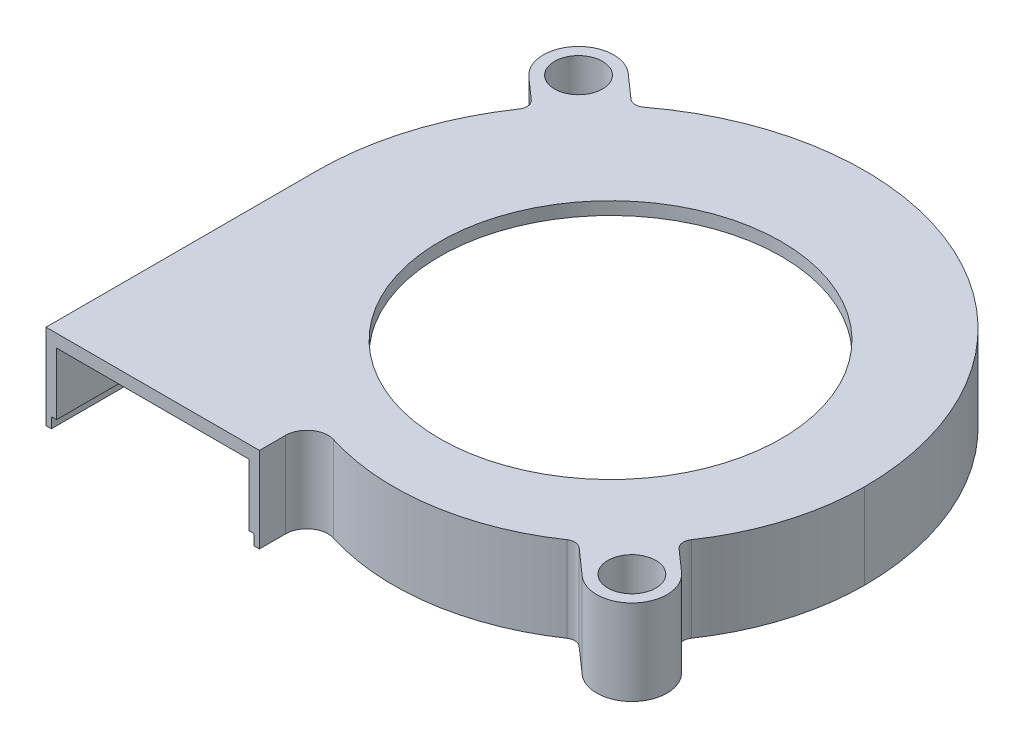
ISO-10303-21;
HEADER;
FILE_DESCRIPTION(('STEP AP214'),'2;1');
FILE_NAME('part.step','',(''),(''),'','','');
FILE_SCHEMA(('AUTOMOTIVE_DESIGN { 1 0 10303 214 1 1 1 1 }'));
ENDSEC;
DATA;
#1=APPLICATION_CONTEXT('core data for automotive mechanical design processes');
#2=APPLICATION_PROTOCOL_DEFINITION('international standard','automotive_design',2000,#1);
#3=PRODUCT_CONTEXT('',#1,'mechanical');
#4=PRODUCT('Part','Part','',(#3));
#5=PRODUCT_RELATED_PRODUCT_CATEGORY('part','',(#4));
#6=PRODUCT_DEFINITION_FORMATION('','',#4);
#7=PRODUCT_DEFINITION_CONTEXT('part definition',#1,'design');
#8=PRODUCT_DEFINITION('design','',#6,#7);
#9=PRODUCT_DEFINITION_SHAPE('','',#8);
#10=(LENGTH_UNIT() NAMED_UNIT(*) SI_UNIT(.MILLI.,.METRE.));
#11=(NAMED_UNIT(*) PLANE_ANGLE_UNIT() SI_UNIT($,.RADIAN.));
#12=(NAMED_UNIT(*) SI_UNIT($,.STERADIAN.) SOLID_ANGLE_UNIT());
#13=UNCERTAINTY_MEASURE_WITH_UNIT(LENGTH_MEASURE(1.E-05),#10,'distance_accuracy_value','');
#14=(GEOMETRIC_REPRESENTATION_CONTEXT(3) GLOBAL_UNCERTAINTY_ASSIGNED_CONTEXT((#13)) GLOBAL_UNIT_ASSIGNED_CONTEXT((#10,
#11,#12)) REPRESENTATION_CONTEXT('',''));
#15=CARTESIAN_POINT('',(0.,0.,0.));
#16=DIRECTION('',(0.,0.,1.));
#17=DIRECTION('',(1.,0.,0.));
#18=AXIS2_PLACEMENT_3D('',#15,#16,#17);
#19=CARTESIAN_POINT('',(-8.5,70.26503959981,25.4));
#20=DIRECTION('',(1.,0.,0.));
#21=DIRECTION('',(0.,0.,-1.));
#22=AXIS2_PLACEMENT_3D('',#19,#20,#21);
#23=PLANE('',#22);
#24=DIRECTION('',(0.,0.,-1.));
#25=VECTOR('',#24,1.);
#26=CARTESIAN_POINT('',(-8.5,-7.,22.9558491109208));
#27=LINE('',#26,#25);
#28=CARTESIAN_POINT('',(-8.5,-7.,25.4));
#29=VERTEX_POINT('',#28);
#30=CARTESIAN_POINT('',(-8.5,-7.,22.9558491109208));
#31=VERTEX_POINT('',#30);
#32=EDGE_CURVE('E585',#29,#31,#27,.T.);
#33=ORIENTED_EDGE('',*,*,#32,.F.);
#34=DIRECTION('',(0.,-1.,0.));
#35=VECTOR('',#34,1.);
#36=CARTESIAN_POINT('',(-8.5,70.26503959981,25.4));
#37=LINE('',#36,#35);
#38=CARTESIAN_POINT('',(-8.5,-1.20000000000001,25.4));
#39=VERTEX_POINT('',#38);
#40=EDGE_CURVE('E496',#39,#29,#37,.T.);
#41=ORIENTED_EDGE('',*,*,#40,.F.);
#42=DIRECTION('',(0.,0.,-1.));
#43=VECTOR('',#42,1.);
#44=CARTESIAN_POINT('',(-8.5,-1.20000000000001,25.4));
#45=LINE('',#44,#43);
#46=CARTESIAN_POINT('',(-8.49999999999999,-1.20000000000001,22.9558491109208));
#47=VERTEX_POINT('',#46);
#48=EDGE_CURVE('E588',#39,#47,#45,.T.);
#49=ORIENTED_EDGE('',*,*,#48,.T.);
#50=DIRECTION('',(0.,-1.,0.));
#51=VECTOR('',#50,1.);
#52=CARTESIAN_POINT('',(-8.5,70.26503959981,22.9558491109208));
#53=LINE('',#52,#51);
#54=EDGE_CURVE('E500',#47,#31,#53,.T.);
#55=ORIENTED_EDGE('',*,*,#54,.T.);
#56=EDGE_LOOP('',(#33,#41,#49,#55));
#57=FACE_BOUND('',#56,.T.);
#58=ADVANCED_FACE('F36',(#57),#23,.F.);
#59=CARTESIAN_POINT('',(-5.5,70.26503959981,22.9558491109208));
#60=DIRECTION('',(0.,-1.,0.));
#61=DIRECTION('',(0.,0.,-1.));
#62=AXIS2_PLACEMENT_3D('',#59,#60,#61);
#63=CYLINDRICAL_SURFACE('',#62,3.);
#64=CARTESIAN_POINT('',(-5.5,-7.,22.9558491109208));
#65=DIRECTION('',(0.,-1.,0.));
#66=DIRECTION('',(0.,0.,-1.));
#67=AXIS2_PLACEMENT_3D('',#64,#65,#66);
#68=CIRCLE('',#67,3.);
#69=CARTESIAN_POINT('',(-4.5985649942554,-7.,20.0944831905794));
#70=VERTEX_POINT('',#69);
#71=EDGE_CURVE('E574',#31,#70,#68,.T.);
#72=ORIENTED_EDGE('',*,*,#71,.F.);
#73=ORIENTED_EDGE('',*,*,#54,.F.);
#74=CARTESIAN_POINT('',(-5.5,-1.20000000000001,22.9558491109208));
#75=DIRECTION('',(0.,-1.,0.));
#76=DIRECTION('',(0.,0.,-1.));
#77=AXIS2_PLACEMENT_3D('',#74,#75,#76);
#78=CIRCLE('',#77,3.);
#79=CARTESIAN_POINT('',(-4.59856499423902,-1.20000000000001,20.0944831905274));
#80=VERTEX_POINT('',#79);
#81=EDGE_CURVE('E487',#47,#80,#78,.T.);
#82=ORIENTED_EDGE('',*,*,#81,.T.);
#83=DIRECTION('',(0.,-1.,0.));
#84=VECTOR('',#83,1.);
#85=CARTESIAN_POINT('',(-4.59856499423902,70.26503959981,20.0944831905274));
#86=LINE('',#85,#84);
#87=EDGE_CURVE('E484',#80,#70,#86,.T.);
#88=ORIENTED_EDGE('',*,*,#87,.T.);
#89=EDGE_LOOP('',(#72,#73,#82,#88));
#90=FACE_BOUND('',#89,.T.);
#91=ADVANCED_FACE('F305',(#90),#63,.T.);
#92=CARTESIAN_POINT('',(1.73193277310925,70.26503959981,0.));
#93=DIRECTION('',(0.,-1.,0.));
#94=DIRECTION('',(0.,0.,-1.));
#95=AXIS2_PLACEMENT_3D('',#92,#93,#94);
#96=CYLINDRICAL_SURFACE('',#95,21.0680672268908);
#97=CARTESIAN_POINT('',(1.73193277310925,-7.,0.));
#98=DIRECTION('',(0.,1.,0.));
#99=DIRECTION('',(0.,0.,-1.));
#100=AXIS2_PLACEMENT_3D('',#97,#98,#99);
#101=CIRCLE('',#100,21.0680672269453);
#102=CARTESIAN_POINT('',(22.800000024916,-7.,-0.000327043078988983));
#103=VERTEX_POINT('',#102);
#104=EDGE_CURVE('E601',#70,#103,#101,.T.);
#105=ORIENTED_EDGE('',*,*,#104,.F.);
#106=ORIENTED_EDGE('',*,*,#87,.F.);
#107=CARTESIAN_POINT('',(1.73193277310925,-1.20000000000001,0.));
#108=DIRECTION('',(0.,-1.,0.));
#109=DIRECTION('',(0.,0.,-1.));
#110=AXIS2_PLACEMENT_3D('',#107,#108,#109);
#111=CIRCLE('',#110,21.0680672268908);
#112=CARTESIAN_POINT('',(22.7999999974641,-1.20000000000001,-0.000326883642031274));
#113=VERTEX_POINT('',#112);
#114=EDGE_CURVE('E478',#80,#113,#111,.F.);
#115=ORIENTED_EDGE('',*,*,#114,.T.);
#116=DIRECTION('',(0.,-1.,0.));
#117=VECTOR('',#116,1.);
#118=CARTESIAN_POINT('',(22.7999999974641,70.26503959981,-0.000326883642031271));
#119=LINE('',#118,#117);
#120=EDGE_CURVE('E482',#113,#103,#119,.T.);
#121=ORIENTED_EDGE('',*,*,#120,.T.);
#122=EDGE_LOOP('',(#105,#106,#115,#121));
#123=FACE_BOUND('',#122,.T.);
#124=ADVANCED_FACE('F311',(#123),#96,.F.);
#125=CARTESIAN_POINT('',(-1.85,70.26503959981,-0.016796874999999));
#126=DIRECTION('',(0.,-1.,0.));
#127=DIRECTION('',(0.,0.,-1.));
#128=AXIS2_PLACEMENT_3D('',#125,#126,#127);
#129=CYLINDRICAL_SURFACE('',#128,24.6500054997072);
#130=CARTESIAN_POINT('',(-1.85,-7.,-0.016796874999999));
#131=DIRECTION('',(0.,1.,0.));
#132=DIRECTION('',(0.,0.,-1.));
#133=AXIS2_PLACEMENT_3D('',#130,#131,#132);
#134=CIRCLE('',#133,24.6500055270525);
#135=CARTESIAN_POINT('',(-26.5000000525161,-7.00000000000001,-0.000327424430267257));
#136=VERTEX_POINT('',#135);
#137=EDGE_CURVE('E53',#103,#136,#134,.T.);
#138=ORIENTED_EDGE('',*,*,#137,.F.);
#139=ORIENTED_EDGE('',*,*,#120,.F.);
#140=CARTESIAN_POINT('',(-1.85,-1.20000000000001,-0.016796874999999));
#141=DIRECTION('',(0.,-1.,0.));
#142=DIRECTION('',(0.,0.,-1.));
#143=AXIS2_PLACEMENT_3D('',#140,#141,#142);
#144=CIRCLE('',#143,24.6500054997072);
#145=CARTESIAN_POINT('',(-26.5000000525161,-1.20000000000001,-0.000327424430267257));
#146=VERTEX_POINT('',#145);
#147=EDGE_CURVE('E488',#113,#146,#144,.F.);
#148=ORIENTED_EDGE('',*,*,#147,.T.);
#149=DIRECTION('',(0.,-1.,0.));
#150=VECTOR('',#149,1.);
#151=CARTESIAN_POINT('',(-26.5000000525161,70.26503959981,-0.000327424430267257));
#152=LINE('',#151,#150);
#153=EDGE_CURVE('E498',#146,#136,#152,.T.);
#154=ORIENTED_EDGE('',*,*,#153,.T.);
#155=EDGE_LOOP('',(#138,#139,#148,#154));
#156=FACE_BOUND('',#155,.T.);
#157=ADVANCED_FACE('F321',(#156),#129,.F.);
#158=CARTESIAN_POINT('',(-26.5000001072067,70.26503959981,-0.000327424393735107));
#159=DIRECTION('',(-1.,0.,4.22068338812948E-09));
#160=DIRECTION('',(4.22068338812948E-09,0.,1.));
#161=AXIS2_PLACEMENT_3D('',#158,#159,#160);
#162=PLANE('',#161);
#163=DIRECTION('',(-4.28055939719574E-11,0.,1.));
#164=VECTOR('',#163,1.);
#165=CARTESIAN_POINT('',(-26.5000000536034,-7.,25.4));
#166=LINE('',#165,#164);
#167=CARTESIAN_POINT('',(-26.5000000536034,-7.,25.4));
#168=VERTEX_POINT('',#167);
#169=EDGE_CURVE('E606',#136,#168,#166,.T.);
#170=ORIENTED_EDGE('',*,*,#169,.F.);
#171=ORIENTED_EDGE('',*,*,#153,.F.);
#172=DIRECTION('',(4.22068338812948E-09,0.,1.));
#173=VECTOR('',#172,1.);
#174=CARTESIAN_POINT('',(-26.5000001072067,-1.20000000000001,-0.000327424393735107));
#175=LINE('',#174,#173);
#176=CARTESIAN_POINT('',(-26.5,-1.20000000000001,25.4));
#177=VERTEX_POINT('',#176);
#178=EDGE_CURVE('E493',#146,#177,#175,.T.);
#179=ORIENTED_EDGE('',*,*,#178,.T.);
#180=DIRECTION('',(0.,-1.,0.));
#181=VECTOR('',#180,1.);
#182=CARTESIAN_POINT('',(-26.5,70.26503959981,25.4));
#183=LINE('',#182,#181);
#184=EDGE_CURVE('E502',#177,#168,#183,.T.);
#185=ORIENTED_EDGE('',*,*,#184,.T.);
#186=EDGE_LOOP('',(#170,#171,#179,#185));
#187=FACE_BOUND('',#186,.T.);
#188=ADVANCED_FACE('F325',(#187),#162,.F.);
#189=CARTESIAN_POINT('',(0.,-8.,0.));
#190=DIRECTION('',(0.,1.,0.));
#191=DIRECTION('',(0.,0.,1.));
#192=AXIS2_PLACEMENT_3D('',#189,#190,#191);
#193=CYLINDRICAL_SURFACE('',#192,16.);
#194=CARTESIAN_POINT('',(0.,0.,0.));
#195=DIRECTION('',(0.,1.,0.));
#196=DIRECTION('',(0.,0.,1.));
#197=AXIS2_PLACEMENT_3D('',#194,#195,#196);
#198=CIRCLE('',#197,16.);
#199=CARTESIAN_POINT('',(0.,0.,16.));
#200=VERTEX_POINT('',#199);
#201=EDGE_CURVE('E349',#200,#200,#198,.T.);
#202=ORIENTED_EDGE('',*,*,#201,.T.);
#203=EDGE_LOOP('',(#202));
#204=FACE_BOUND('',#203,.T.);
#205=CARTESIAN_POINT('',(0.,-1.2,0.));
#206=DIRECTION('',(0.,-1.,0.));
#207=DIRECTION('',(0.,0.,-1.));
#208=AXIS2_PLACEMENT_3D('',#205,#206,#207);
#209=CIRCLE('',#208,16.);
#210=CARTESIAN_POINT('',(0.,-1.2,-16.));
#211=VERTEX_POINT('',#210);
#212=EDGE_CURVE('E40',#211,#211,#209,.F.);
#213=ORIENTED_EDGE('',*,*,#212,.F.);
#214=EDGE_LOOP('',(#213));
#215=FACE_BOUND('',#214,.T.);
#216=ADVANCED_FACE('F302',(#204,#215),#193,.F.);
#217=CARTESIAN_POINT('',(-23.,-8.,-20.));
#218=DIRECTION('',(0.,1.,0.));
#219=DIRECTION('',(0.,0.,1.));
#220=AXIS2_PLACEMENT_3D('',#217,#218,#219);
#221=CYLINDRICAL_SURFACE('',#220,3.3);
#222=CARTESIAN_POINT('',(-23.,0.,-20.));
#223=DIRECTION('',(0.,1.,0.));
#224=DIRECTION('',(0.,0.,-1.));
#225=AXIS2_PLACEMENT_3D('',#222,#223,#224);
#226=CIRCLE('',#225,3.3);
#227=CARTESIAN_POINT('',(-20.8147472716434,0.,-22.4727859820878));
#228=VERTEX_POINT('',#227);
#229=CARTESIAN_POINT('',(-25.1852527283566,0.,-17.5272140179122));
#230=VERTEX_POINT('',#229);
#231=EDGE_CURVE('E210',#228,#230,#226,.T.);
#232=ORIENTED_EDGE('',*,*,#231,.F.);
#233=DIRECTION('',(0.,1.,0.));
#234=VECTOR('',#233,1.);
#235=CARTESIAN_POINT('',(-20.8147472716434,-8.,-22.4727859820878));
#236=LINE('',#235,#234);
#237=CARTESIAN_POINT('',(-20.8147472716434,-8.,-22.4727859820878));
#238=VERTEX_POINT('',#237);
#239=EDGE_CURVE('E12',#238,#228,#236,.T.);
#240=ORIENTED_EDGE('',*,*,#239,.F.);
#241=CARTESIAN_POINT('',(-23.,-8.,-20.));
#242=DIRECTION('',(0.,1.,0.));
#243=DIRECTION('',(0.,0.,-1.));
#244=AXIS2_PLACEMENT_3D('',#241,#242,#243);
#245=CIRCLE('',#244,3.3);
#246=CARTESIAN_POINT('',(-25.1852527283566,-8.,-17.5272140179122));
#247=VERTEX_POINT('',#246);
#248=EDGE_CURVE('E261',#238,#247,#245,.T.);
#249=ORIENTED_EDGE('',*,*,#248,.T.);
#250=DIRECTION('',(0.,1.,0.));
#251=VECTOR('',#250,1.);
#252=CARTESIAN_POINT('',(-25.1852527283566,-8.,-17.5272140179122));
#253=LINE('',#252,#251);
#254=EDGE_CURVE('E129',#247,#230,#253,.T.);
#255=ORIENTED_EDGE('',*,*,#254,.T.);
#256=EDGE_LOOP('',(#232,#240,#249,#255));
#257=FACE_BOUND('',#256,.T.);
#258=ADVANCED_FACE('F38',(#257),#221,.T.);
#259=CARTESIAN_POINT('',(-20.8147472716434,-8.,-22.4727859820878));
#260=DIRECTION('',(0.66219779647171,0.,-0.749329085481147));
#261=DIRECTION('',(-0.749329085481147,0.,-0.66219779647171));
#262=AXIS2_PLACEMENT_3D('',#259,#260,#261);
#263=PLANE('',#262);
#264=DIRECTION('',(-0.749329085481147,0.,-0.66219779647171));
#265=VECTOR('',#264,1.);
#266=CARTESIAN_POINT('',(-20.8147472716434,0.,-22.4727859820878));
#267=LINE('',#266,#265);
#268=CARTESIAN_POINT('',(-18.5989053771657,0.,-20.5146001218517));
#269=VERTEX_POINT('',#268);
#270=EDGE_CURVE('E259',#269,#228,#267,.T.);
#271=ORIENTED_EDGE('',*,*,#270,.F.);
#272=DIRECTION('',(0.,1.,0.));
#273=VECTOR('',#272,1.);
#274=CARTESIAN_POINT('',(-18.5989053771657,-8.,-20.5146001218517));
#275=LINE('',#274,#273);
#276=CARTESIAN_POINT('',(-18.5989053771657,-8.,-20.5146001218517));
#277=VERTEX_POINT('',#276);
#278=EDGE_CURVE('E45',#277,#269,#275,.T.);
#279=ORIENTED_EDGE('',*,*,#278,.F.);
#280=DIRECTION('',(-0.749329085481147,0.,-0.66219779647171));
#281=VECTOR('',#280,1.);
#282=CARTESIAN_POINT('',(-20.8147472716434,-8.,-22.4727859820878));
#283=LINE('',#282,#281);
#284=EDGE_CURVE('E200',#277,#238,#283,.T.);
#285=ORIENTED_EDGE('',*,*,#284,.T.);
#286=ORIENTED_EDGE('',*,*,#239,.T.);
#287=EDGE_LOOP('',(#271,#279,#285,#286));
#288=FACE_BOUND('',#287,.T.);
#289=ADVANCED_FACE('F294',(#288),#263,.T.);
#290=CARTESIAN_POINT('',(-17.936707580694,-8.,-21.2639292073329));
#291=DIRECTION('',(0.,1.,0.));
#292=DIRECTION('',(0.,0.,1.));
#293=AXIS2_PLACEMENT_3D('',#290,#291,#292);
#294=CYLINDRICAL_SURFACE('',#293,1.);
#295=CARTESIAN_POINT('',(-17.936707580694,0.,-21.2639292073329));
#296=DIRECTION('',(0.,-1.,0.));
#297=DIRECTION('',(0.,0.,1.));
#298=AXIS2_PLACEMENT_3D('',#295,#296,#297);
#299=CIRCLE('',#298,1.);
#300=CARTESIAN_POINT('',(-17.3330789029862,0.,-20.4666636183045));
#301=VERTEX_POINT('',#300);
#302=EDGE_CURVE('E185',#301,#269,#299,.T.);
#303=ORIENTED_EDGE('',*,*,#302,.F.);
#304=DIRECTION('',(0.,1.,0.));
#305=VECTOR('',#304,1.);
#306=CARTESIAN_POINT('',(-17.3330789029862,-8.,-20.4666636183045));
#307=LINE('',#306,#305);
#308=CARTESIAN_POINT('',(-17.3330789029862,-8.,-20.4666636183045));
#309=VERTEX_POINT('',#308);
#310=EDGE_CURVE('E179',#309,#301,#307,.T.);
#311=ORIENTED_EDGE('',*,*,#310,.F.);
#312=CARTESIAN_POINT('',(-17.936707580694,-8.,-21.2639292073329));
#313=DIRECTION('',(0.,-1.,0.));
#314=DIRECTION('',(0.,0.,1.));
#315=AXIS2_PLACEMENT_3D('',#312,#313,#314);
#316=CIRCLE('',#315,1.);
#317=EDGE_CURVE('E182',#309,#277,#316,.T.);
#318=ORIENTED_EDGE('',*,*,#317,.T.);
#319=ORIENTED_EDGE('',*,*,#278,.T.);
#320=EDGE_LOOP('',(#303,#311,#318,#319));
#321=FACE_BOUND('',#320,.T.);
#322=ADVANCED_FACE('F181',(#321),#294,.F.);
#323=CARTESIAN_POINT('',(-1.85,-8.,-0.016796874999999));
#324=DIRECTION('',(0.,1.,0.));
#325=DIRECTION('',(0.,0.,1.));
#326=AXIS2_PLACEMENT_3D('',#323,#324,#325);
#327=CYLINDRICAL_SURFACE('',#326,25.6500054997072);
#328=CARTESIAN_POINT('',(-1.85,0.,-0.016796874999999));
#329=DIRECTION('',(0.,1.,0.));
#330=DIRECTION('',(0.,0.,1.));
#331=AXIS2_PLACEMENT_3D('',#328,#329,#330);
#332=CIRCLE('',#331,25.6500054997072);
#333=CARTESIAN_POINT('',(23.8,0.,0.));
#334=VERTEX_POINT('',#333);
#335=EDGE_CURVE('E256',#334,#301,#332,.T.);
#336=ORIENTED_EDGE('',*,*,#335,.F.);
#337=DIRECTION('',(0.,1.,0.));
#338=VECTOR('',#337,1.);
#339=CARTESIAN_POINT('',(23.8,-8.,0.));
#340=LINE('',#339,#338);
#341=CARTESIAN_POINT('',(23.8,-8.,0.));
#342=VERTEX_POINT('',#341);
#343=EDGE_CURVE('E190',#342,#334,#340,.T.);
#344=ORIENTED_EDGE('',*,*,#343,.F.);
#345=CARTESIAN_POINT('',(-1.85,-8.,-0.016796874999999));
#346=DIRECTION('',(0.,1.,0.));
#347=DIRECTION('',(0.,0.,1.));
#348=AXIS2_PLACEMENT_3D('',#345,#346,#347);
#349=CIRCLE('',#348,25.6500054997072);
#350=EDGE_CURVE('E198',#342,#309,#349,.T.);
#351=ORIENTED_EDGE('',*,*,#350,.T.);
#352=ORIENTED_EDGE('',*,*,#310,.T.);
#353=EDGE_LOOP('',(#336,#344,#351,#352));
#354=FACE_BOUND('',#353,.T.);
#355=ADVANCED_FACE('F202',(#354),#327,.T.);
#356=CARTESIAN_POINT('',(1.73193277310925,-8.,0.));
#357=DIRECTION('',(0.,1.,0.));
#358=DIRECTION('',(0.,0.,1.));
#359=AXIS2_PLACEMENT_3D('',#356,#357,#358);
#360=CYLINDRICAL_SURFACE('',#359,22.0680672268908);
#361=CARTESIAN_POINT('',(1.73193277310925,0.,0.));
#362=DIRECTION('',(0.,1.,0.));
#363=DIRECTION('',(0.,0.,-1.));
#364=AXIS2_PLACEMENT_3D('',#361,#362,#363);
#365=CIRCLE('',#364,22.0680672268908);
#366=CARTESIAN_POINT('',(19.9790752063348,0.,12.4113409489929));
#367=VERTEX_POINT('',#366);
#368=EDGE_CURVE('E253',#367,#334,#365,.T.);
#369=ORIENTED_EDGE('',*,*,#368,.F.);
#370=DIRECTION('',(0.,1.,0.));
#371=VECTOR('',#370,1.);
#372=CARTESIAN_POINT('',(19.9790752063348,-8.,12.4113409489929));
#373=LINE('',#372,#371);
#374=CARTESIAN_POINT('',(19.9790752063348,-8.,12.4113409489929));
#375=VERTEX_POINT('',#374);
#376=EDGE_CURVE('E265',#375,#367,#373,.T.);
#377=ORIENTED_EDGE('',*,*,#376,.F.);
#378=CARTESIAN_POINT('',(1.73193277310925,-8.,0.));
#379=DIRECTION('',(0.,1.,0.));
#380=DIRECTION('',(0.,0.,-1.));
#381=AXIS2_PLACEMENT_3D('',#378,#379,#380);
#382=CIRCLE('',#381,22.0680672268908);
#383=EDGE_CURVE('E203',#375,#342,#382,.T.);
#384=ORIENTED_EDGE('',*,*,#383,.T.);
#385=ORIENTED_EDGE('',*,*,#343,.T.);
#386=EDGE_LOOP('',(#369,#377,#384,#385));
#387=FACE_BOUND('',#386,.T.);
#388=ADVANCED_FACE('F664',(#387),#360,.T.);
#389=CARTESIAN_POINT('',(20.8059325040591,-8.,12.9737527280304));
#390=DIRECTION('',(0.,1.,0.));
#391=DIRECTION('',(0.,0.,1.));
#392=AXIS2_PLACEMENT_3D('',#389,#390,#391);
#393=CYLINDRICAL_SURFACE('',#392,1.);
#394=CARTESIAN_POINT('',(20.8059325040591,0.,12.9737527280304));
#395=DIRECTION('',(0.,-1.,0.));
#396=DIRECTION('',(0.,0.,-1.));
#397=AXIS2_PLACEMENT_3D('',#394,#395,#396);
#398=CIRCLE('',#397,1.);
#399=CARTESIAN_POINT('',(20.1437347075874,0.,13.7230818135115));
#400=VERTEX_POINT('',#399);
#401=EDGE_CURVE('E250',#400,#367,#398,.T.);
#402=ORIENTED_EDGE('',*,*,#401,.F.);
#403=DIRECTION('',(0.,1.,0.));
#404=VECTOR('',#403,1.);
#405=CARTESIAN_POINT('',(20.1437347075874,-8.,13.7230818135115));
#406=LINE('',#405,#404);
#407=CARTESIAN_POINT('',(20.1437347075874,-8.,13.7230818135115));
#408=VERTEX_POINT('',#407);
#409=EDGE_CURVE('E267',#408,#400,#406,.T.);
#410=ORIENTED_EDGE('',*,*,#409,.F.);
#411=CARTESIAN_POINT('',(20.8059325040591,-8.,12.9737527280304));
#412=DIRECTION('',(0.,-1.,0.));
#413=DIRECTION('',(0.,0.,-1.));
#414=AXIS2_PLACEMENT_3D('',#411,#412,#413);
#415=CIRCLE('',#414,1.);
#416=EDGE_CURVE('E205',#408,#375,#415,.T.);
#417=ORIENTED_EDGE('',*,*,#416,.T.);
#418=ORIENTED_EDGE('',*,*,#376,.T.);
#419=EDGE_LOOP('',(#402,#410,#417,#418));
#420=FACE_BOUND('',#419,.T.);
#421=ADVANCED_FACE('F406',(#420),#393,.F.);
#422=CARTESIAN_POINT('',(22.1852527283566,-8.,15.5272140179122));
#423=DIRECTION('',(0.66219779647171,0.,-0.749329085481147));
#424=DIRECTION('',(-0.749329085481147,0.,-0.66219779647171));
#425=AXIS2_PLACEMENT_3D('',#422,#423,#424);
#426=PLANE('',#425);
#427=DIRECTION('',(-0.749329085481146,0.,-0.66219779647171));
#428=VECTOR('',#427,1.);
#429=CARTESIAN_POINT('',(22.1852527283566,0.,15.5272140179122));
#430=LINE('',#429,#428);
#431=CARTESIAN_POINT('',(22.1852527283566,0.,15.5272140179122));
#432=VERTEX_POINT('',#431);
#433=EDGE_CURVE('E247',#432,#400,#430,.T.);
#434=ORIENTED_EDGE('',*,*,#433,.F.);
#435=DIRECTION('',(0.,1.,0.));
#436=VECTOR('',#435,1.);
#437=CARTESIAN_POINT('',(22.1852527283566,-8.,15.5272140179122));
#438=LINE('',#437,#436);
#439=CARTESIAN_POINT('',(22.1852527283566,-8.,15.5272140179122));
#440=VERTEX_POINT('',#439);
#441=EDGE_CURVE('E269',#440,#432,#438,.T.);
#442=ORIENTED_EDGE('',*,*,#441,.F.);
#443=DIRECTION('',(-0.749329085481146,0.,-0.66219779647171));
#444=VECTOR('',#443,1.);
#445=CARTESIAN_POINT('',(22.1852527283566,-8.,15.5272140179122));
#446=LINE('',#445,#444);
#447=EDGE_CURVE('E400',#440,#408,#446,.T.);
#448=ORIENTED_EDGE('',*,*,#447,.T.);
#449=ORIENTED_EDGE('',*,*,#409,.T.);
#450=EDGE_LOOP('',(#434,#442,#448,#449));
#451=FACE_BOUND('',#450,.T.);
#452=ADVANCED_FACE('F412',(#451),#426,.T.);
#453=CARTESIAN_POINT('',(20.,-8.,18.));
#454=DIRECTION('',(0.,1.,0.));
#455=DIRECTION('',(0.,0.,1.));
#456=AXIS2_PLACEMENT_3D('',#453,#454,#455);
#457=CYLINDRICAL_SURFACE('',#456,3.3);
#458=CARTESIAN_POINT('',(20.,0.,18.));
#459=DIRECTION('',(0.,1.,0.));
#460=DIRECTION('',(0.,0.,-1.));
#461=AXIS2_PLACEMENT_3D('',#458,#459,#460);
#462=CIRCLE('',#461,3.3);
#463=CARTESIAN_POINT('',(17.8147472716434,0.,20.4727859820878));
#464=VERTEX_POINT('',#463);
#465=EDGE_CURVE('E244',#464,#432,#462,.T.);
#466=ORIENTED_EDGE('',*,*,#465,.F.);
#467=DIRECTION('',(0.,1.,0.));
#468=VECTOR('',#467,1.);
#469=CARTESIAN_POINT('',(17.8147472716434,-8.,20.4727859820878));
#470=LINE('',#469,#468);
#471=CARTESIAN_POINT('',(17.8147472716434,-8.,20.4727859820878));
#472=VERTEX_POINT('',#471);
#473=EDGE_CURVE('E271',#472,#464,#470,.T.);
#474=ORIENTED_EDGE('',*,*,#473,.F.);
#475=CARTESIAN_POINT('',(20.,-8.,18.));
#476=DIRECTION('',(0.,1.,0.));
#477=DIRECTION('',(0.,0.,-1.));
#478=AXIS2_PLACEMENT_3D('',#475,#476,#477);
#479=CIRCLE('',#478,3.3);
#480=EDGE_CURVE('E397',#472,#440,#479,.T.);
#481=ORIENTED_EDGE('',*,*,#480,.T.);
#482=ORIENTED_EDGE('',*,*,#441,.T.);
#483=EDGE_LOOP('',(#466,#474,#481,#482));
#484=FACE_BOUND('',#483,.T.);
#485=ADVANCED_FACE('F415',(#484),#457,.T.);
#486=CARTESIAN_POINT('',(17.8147472716434,-8.,20.4727859820878));
#487=DIRECTION('',(-0.66219779647171,0.,0.749329085481147));
#488=DIRECTION('',(0.749329085481147,0.,0.66219779647171));
#489=AXIS2_PLACEMENT_3D('',#486,#487,#488);
#490=PLANE('',#489);
#491=DIRECTION('',(0.749329085481147,0.,0.66219779647171));
#492=VECTOR('',#491,1.);
#493=CARTESIAN_POINT('',(17.8147472716434,0.,20.4727859820878));
#494=LINE('',#493,#492);
#495=CARTESIAN_POINT('',(15.3769800356374,0.,18.3184800525942));
#496=VERTEX_POINT('',#495);
#497=EDGE_CURVE('E241',#496,#464,#494,.T.);
#498=ORIENTED_EDGE('',*,*,#497,.F.);
#499=DIRECTION('',(0.,1.,0.));
#500=VECTOR('',#499,1.);
#501=CARTESIAN_POINT('',(15.3769800356374,-8.,18.3184800525942));
#502=LINE('',#501,#500);
#503=CARTESIAN_POINT('',(15.3769800356374,-8.,18.3184800525942));
#504=VERTEX_POINT('',#503);
#505=EDGE_CURVE('E273',#504,#496,#502,.T.);
#506=ORIENTED_EDGE('',*,*,#505,.F.);
#507=DIRECTION('',(0.749329085481147,0.,0.66219779647171));
#508=VECTOR('',#507,1.);
#509=CARTESIAN_POINT('',(17.8147472716434,-8.,20.4727859820878));
#510=LINE('',#509,#508);
#511=EDGE_CURVE('E394',#504,#472,#510,.T.);
#512=ORIENTED_EDGE('',*,*,#511,.T.);
#513=ORIENTED_EDGE('',*,*,#473,.T.);
#514=EDGE_LOOP('',(#498,#506,#512,#513));
#515=FACE_BOUND('',#514,.T.);
#516=ADVANCED_FACE('F420',(#515),#490,.T.);
#517=CARTESIAN_POINT('',(14.7147822391657,-8.,19.0678091380753));
#518=DIRECTION('',(0.,1.,0.));
#519=DIRECTION('',(0.,0.,1.));
#520=AXIS2_PLACEMENT_3D('',#517,#518,#519);
#521=CYLINDRICAL_SURFACE('',#520,0.999999999999999);
#522=CARTESIAN_POINT('',(14.7147822391657,0.,19.0678091380753));
#523=DIRECTION('',(0.,-1.,0.));
#524=DIRECTION('',(0.,0.,1.));
#525=AXIS2_PLACEMENT_3D('',#522,#523,#524);
#526=CIRCLE('',#525,0.999999999999999);
#527=CARTESIAN_POINT('',(14.1519761168165,0.,18.2412202023604));
#528=VERTEX_POINT('',#527);
#529=EDGE_CURVE('E238',#528,#496,#526,.T.);
#530=ORIENTED_EDGE('',*,*,#529,.F.);
#531=DIRECTION('',(0.,1.,0.));
#532=VECTOR('',#531,1.);
#533=CARTESIAN_POINT('',(14.1519761168165,-8.,18.2412202023604));
#534=LINE('',#533,#532);
#535=CARTESIAN_POINT('',(14.1519761168165,-8.,18.2412202023604));
#536=VERTEX_POINT('',#535);
#537=EDGE_CURVE('E275',#536,#528,#534,.T.);
#538=ORIENTED_EDGE('',*,*,#537,.F.);
#539=CARTESIAN_POINT('',(14.7147822391657,-8.,19.0678091380753));
#540=DIRECTION('',(0.,-1.,0.));
#541=DIRECTION('',(0.,0.,1.));
#542=AXIS2_PLACEMENT_3D('',#539,#540,#541);
#543=CIRCLE('',#542,0.999999999999999);
#544=EDGE_CURVE('E391',#536,#504,#543,.T.);
#545=ORIENTED_EDGE('',*,*,#544,.T.);
#546=ORIENTED_EDGE('',*,*,#505,.T.);
#547=EDGE_LOOP('',(#530,#538,#545,#546));
#548=FACE_BOUND('',#547,.T.);
#549=ADVANCED_FACE('F423',(#548),#521,.F.);
#550=CARTESIAN_POINT('',(1.73193277310925,-8.,0.));
#551=DIRECTION('',(0.,1.,0.));
#552=DIRECTION('',(0.,0.,1.));
#553=AXIS2_PLACEMENT_3D('',#550,#551,#552);
#554=CYLINDRICAL_SURFACE('',#553,22.0680672268908);
#555=CARTESIAN_POINT('',(1.73193277310925,0.,0.));
#556=DIRECTION('',(0.,1.,0.));
#557=DIRECTION('',(0.,0.,-1.));
#558=AXIS2_PLACEMENT_3D('',#555,#556,#557);
#559=CIRCLE('',#558,22.0680672268908);
#560=CARTESIAN_POINT('',(-4.89904332949268,0.,21.0482718306585));
#561=VERTEX_POINT('',#560);
#562=EDGE_CURVE('E235',#561,#528,#559,.T.);
#563=ORIENTED_EDGE('',*,*,#562,.F.);
#564=DIRECTION('',(0.,1.,0.));
#565=VECTOR('',#564,1.);
#566=CARTESIAN_POINT('',(-4.89904332949268,-8.,21.0482718306585));
#567=LINE('',#566,#565);
#568=CARTESIAN_POINT('',(-4.89904332949268,-8.,21.0482718306585));
#569=VERTEX_POINT('',#568);
#570=EDGE_CURVE('E277',#569,#561,#567,.T.);
#571=ORIENTED_EDGE('',*,*,#570,.F.);
#572=CARTESIAN_POINT('',(1.73193277310925,-8.,0.));
#573=DIRECTION('',(0.,1.,0.));
#574=DIRECTION('',(0.,0.,-1.));
#575=AXIS2_PLACEMENT_3D('',#572,#573,#574);
#576=CIRCLE('',#575,22.0680672268908);
#577=EDGE_CURVE('E388',#569,#536,#576,.T.);
#578=ORIENTED_EDGE('',*,*,#577,.T.);
#579=ORIENTED_EDGE('',*,*,#537,.T.);
#580=EDGE_LOOP('',(#563,#571,#578,#579));
#581=FACE_BOUND('',#580,.T.);
#582=ADVANCED_FACE('F428',(#581),#554,.T.);
#583=CARTESIAN_POINT('',(-5.5,-8.,22.9558491109208));
#584=DIRECTION('',(0.,1.,0.));
#585=DIRECTION('',(0.,0.,1.));
#586=AXIS2_PLACEMENT_3D('',#583,#584,#585);
#587=CYLINDRICAL_SURFACE('',#586,2.);
#588=CARTESIAN_POINT('',(-5.5,0.,22.9558491109208));
#589=DIRECTION('',(0.,-1.,0.));
#590=DIRECTION('',(0.,0.,1.));
#591=AXIS2_PLACEMENT_3D('',#588,#589,#590);
#592=CIRCLE('',#591,2.);
#593=CARTESIAN_POINT('',(-7.5,0.,22.9558491109208));
#594=VERTEX_POINT('',#593);
#595=EDGE_CURVE('E232',#594,#561,#592,.T.);
#596=ORIENTED_EDGE('',*,*,#595,.F.);
#597=DIRECTION('',(0.,1.,0.));
#598=VECTOR('',#597,1.);
#599=CARTESIAN_POINT('',(-7.5,-8.,22.9558491109208));
#600=LINE('',#599,#598);
#601=CARTESIAN_POINT('',(-7.5,-8.,22.9558491109208));
#602=VERTEX_POINT('',#601);
#603=EDGE_CURVE('E279',#602,#594,#600,.T.);
#604=ORIENTED_EDGE('',*,*,#603,.F.);
#605=CARTESIAN_POINT('',(-5.5,-8.,22.9558491109208));
#606=DIRECTION('',(0.,-1.,0.));
#607=DIRECTION('',(0.,0.,1.));
#608=AXIS2_PLACEMENT_3D('',#605,#606,#607);
#609=CIRCLE('',#608,2.);
#610=EDGE_CURVE('E385',#602,#569,#609,.T.);
#611=ORIENTED_EDGE('',*,*,#610,.T.);
#612=ORIENTED_EDGE('',*,*,#570,.T.);
#613=EDGE_LOOP('',(#596,#604,#611,#612));
#614=FACE_BOUND('',#613,.T.);
#615=ADVANCED_FACE('F431',(#614),#587,.F.);
#616=CARTESIAN_POINT('',(-7.5,-8.,25.4));
#617=DIRECTION('',(1.,0.,0.));
#618=DIRECTION('',(0.,0.,-1.));
#619=AXIS2_PLACEMENT_3D('',#616,#617,#618);
#620=PLANE('',#619);
#621=DIRECTION('',(0.,0.,-1.));
#622=VECTOR('',#621,1.);
#623=CARTESIAN_POINT('',(-7.5,0.,25.4));
#624=LINE('',#623,#622);
#625=CARTESIAN_POINT('',(-7.5,0.,25.4));
#626=VERTEX_POINT('',#625);
#627=EDGE_CURVE('E229',#626,#594,#624,.T.);
#628=ORIENTED_EDGE('',*,*,#627,.F.);
#629=DIRECTION('',(0.,1.,0.));
#630=VECTOR('',#629,1.);
#631=CARTESIAN_POINT('',(-7.5,-8.,25.4));
#632=LINE('',#631,#630);
#633=CARTESIAN_POINT('',(-7.5,-8.,25.4));
#634=VERTEX_POINT('',#633);
#635=EDGE_CURVE('E281',#634,#626,#632,.T.);
#636=ORIENTED_EDGE('',*,*,#635,.F.);
#637=DIRECTION('',(0.,0.,-1.));
#638=VECTOR('',#637,1.);
#639=CARTESIAN_POINT('',(-7.5,-8.,25.4));
#640=LINE('',#639,#638);
#641=EDGE_CURVE('E382',#634,#602,#640,.T.);
#642=ORIENTED_EDGE('',*,*,#641,.T.);
#643=ORIENTED_EDGE('',*,*,#603,.T.);
#644=EDGE_LOOP('',(#628,#636,#642,#643));
#645=FACE_BOUND('',#644,.T.);
#646=ADVANCED_FACE('F437',(#645),#620,.T.);
#647=CARTESIAN_POINT('',(-27.5,-8.,25.4));
#648=DIRECTION('',(0.,0.,1.));
#649=DIRECTION('',(1.,0.,0.));
#650=AXIS2_PLACEMENT_3D('',#647,#648,#649);
#651=PLANE('',#650);
#652=DIRECTION('',(0.,-1.,0.));
#653=VECTOR('',#652,1.);
#654=CARTESIAN_POINT('',(-27.0000000525161,-7.,25.4));
#655=LINE('',#654,#653);
#656=CARTESIAN_POINT('',(-27.0000000525161,-7.,25.4));
#657=VERTEX_POINT('',#656);
#658=CARTESIAN_POINT('',(-27.0000000525161,-8.,25.4));
#659=VERTEX_POINT('',#658);
#660=EDGE_CURVE('E555',#657,#659,#655,.T.);
#661=ORIENTED_EDGE('',*,*,#660,.F.);
#662=DIRECTION('',(-1.,0.,0.));
#663=VECTOR('',#662,1.);
#664=CARTESIAN_POINT('',(-27.0000000525161,-7.,25.4));
#665=LINE('',#664,#663);
#666=EDGE_CURVE('E608',#168,#657,#665,.T.);
#667=ORIENTED_EDGE('',*,*,#666,.F.);
#668=ORIENTED_EDGE('',*,*,#184,.F.);
#669=DIRECTION('',(1.,0.,0.));
#670=VECTOR('',#669,1.);
#671=CARTESIAN_POINT('',(-26.5,-1.20000000000001,25.4));
#672=LINE('',#671,#670);
#673=EDGE_CURVE('E509',#177,#39,#672,.T.);
#674=ORIENTED_EDGE('',*,*,#673,.T.);
#675=ORIENTED_EDGE('',*,*,#40,.T.);
#676=DIRECTION('',(-1.,0.,0.));
#677=VECTOR('',#676,1.);
#678=CARTESIAN_POINT('',(-8.5,-7.,25.4));
#679=LINE('',#678,#677);
#680=CARTESIAN_POINT('',(-8.,-7.,25.4));
#681=VERTEX_POINT('',#680);
#682=EDGE_CURVE('E626',#681,#29,#679,.T.);
#683=ORIENTED_EDGE('',*,*,#682,.F.);
#684=DIRECTION('',(0.,-1.,0.));
#685=VECTOR('',#684,1.);
#686=CARTESIAN_POINT('',(-8.,-7.,25.4));
#687=LINE('',#686,#685);
#688=CARTESIAN_POINT('',(-8.,-8.,25.4));
#689=VERTEX_POINT('',#688);
#690=EDGE_CURVE('E446',#681,#689,#687,.T.);
#691=ORIENTED_EDGE('',*,*,#690,.T.);
#692=DIRECTION('',(1.,0.,0.));
#693=VECTOR('',#692,1.);
#694=CARTESIAN_POINT('',(-27.5,-8.,25.4));
#695=LINE('',#694,#693);
#696=EDGE_CURVE('E378',#689,#634,#695,.T.);
#697=ORIENTED_EDGE('',*,*,#696,.T.);
#698=ORIENTED_EDGE('',*,*,#635,.T.);
#699=DIRECTION('',(1.,0.,0.));
#700=VECTOR('',#699,1.);
#701=CARTESIAN_POINT('',(-27.5,0.,25.4));
#702=LINE('',#701,#700);
#703=CARTESIAN_POINT('',(-27.5,0.,25.4));
#704=VERTEX_POINT('',#703);
#705=EDGE_CURVE('E226',#704,#626,#702,.T.);
#706=ORIENTED_EDGE('',*,*,#705,.F.);
#707=DIRECTION('',(0.,1.,0.));
#708=VECTOR('',#707,1.);
#709=CARTESIAN_POINT('',(-27.5,-8.,25.4));
#710=LINE('',#709,#708);
#711=CARTESIAN_POINT('',(-27.5,-8.,25.4));
#712=VERTEX_POINT('',#711);
#713=EDGE_CURVE('E283',#712,#704,#710,.T.);
#714=ORIENTED_EDGE('',*,*,#713,.F.);
#715=EDGE_CURVE('E379',#712,#659,#695,.T.);
#716=ORIENTED_EDGE('',*,*,#715,.T.);
#717=EDGE_LOOP('',(#661,#667,#668,#674,#675,#683,#691,#697,#698,#706,#714,#716));
#718=FACE_BOUND('',#717,.T.);
#719=ADVANCED_FACE('F441',(#718),#651,.T.);
#720=CARTESIAN_POINT('',(-27.5,-8.,25.4));
#721=DIRECTION('',(-1.,0.,0.));
#722=DIRECTION('',(0.,0.,1.));
#723=AXIS2_PLACEMENT_3D('',#720,#721,#722);
#724=PLANE('',#723);
#725=DIRECTION('',(0.,0.,1.));
#726=VECTOR('',#725,1.);
#727=CARTESIAN_POINT('',(-27.5,0.,25.4));
#728=LINE('',#727,#726);
#729=CARTESIAN_POINT('',(-27.5,0.,0.));
#730=VERTEX_POINT('',#729);
#731=EDGE_CURVE('E223',#730,#704,#728,.T.);
#732=ORIENTED_EDGE('',*,*,#731,.F.);
#733=DIRECTION('',(0.,1.,0.));
#734=VECTOR('',#733,1.);
#735=CARTESIAN_POINT('',(-27.5,-8.,0.));
#736=LINE('',#735,#734);
#737=CARTESIAN_POINT('',(-27.5,-8.,0.));
#738=VERTEX_POINT('',#737);
#739=EDGE_CURVE('E285',#738,#730,#736,.T.);
#740=ORIENTED_EDGE('',*,*,#739,.F.);
#741=DIRECTION('',(0.,0.,1.));
#742=VECTOR('',#741,1.);
#743=CARTESIAN_POINT('',(-27.5,-8.,25.4));
#744=LINE('',#743,#742);
#745=EDGE_CURVE('E375',#738,#712,#744,.T.);
#746=ORIENTED_EDGE('',*,*,#745,.T.);
#747=ORIENTED_EDGE('',*,*,#713,.T.);
#748=EDGE_LOOP('',(#732,#740,#746,#747));
#749=FACE_BOUND('',#748,.T.);
#750=ADVANCED_FACE('F656',(#749),#724,.T.);
#751=CARTESIAN_POINT('',(-1.85,-8.,-0.016796874999999));
#752=DIRECTION('',(0.,1.,0.));
#753=DIRECTION('',(0.,0.,1.));
#754=AXIS2_PLACEMENT_3D('',#751,#752,#753);
#755=CYLINDRICAL_SURFACE('',#754,25.6500054997072);
#756=CARTESIAN_POINT('',(-1.85,0.,-0.016796874999999));
#757=DIRECTION('',(0.,1.,0.));
#758=DIRECTION('',(0.,0.,1.));
#759=AXIS2_PLACEMENT_3D('',#756,#757,#758);
#760=CIRCLE('',#759,25.6500054997072);
#761=CARTESIAN_POINT('',(-23.0428472901912,0.,-14.4662261325744));
#762=VERTEX_POINT('',#761);
#763=EDGE_CURVE('E220',#762,#730,#760,.T.);
#764=ORIENTED_EDGE('',*,*,#763,.F.);
#765=DIRECTION('',(0.,1.,0.));
#766=VECTOR('',#765,1.);
#767=CARTESIAN_POINT('',(-23.0428472901912,-8.,-14.4662261325744));
#768=LINE('',#767,#766);
#769=CARTESIAN_POINT('',(-23.0428472901912,-8.,-14.4662261325744));
#770=VERTEX_POINT('',#769);
#771=EDGE_CURVE('E287',#770,#762,#768,.T.);
#772=ORIENTED_EDGE('',*,*,#771,.F.);
#773=CARTESIAN_POINT('',(-1.85,-8.,-0.016796874999999));
#774=DIRECTION('',(0.,1.,0.));
#775=DIRECTION('',(0.,0.,1.));
#776=AXIS2_PLACEMENT_3D('',#773,#774,#775);
#777=CIRCLE('',#776,25.6500054997072);
#778=EDGE_CURVE('E372',#770,#738,#777,.T.);
#779=ORIENTED_EDGE('',*,*,#778,.T.);
#780=ORIENTED_EDGE('',*,*,#739,.T.);
#781=EDGE_LOOP('',(#764,#772,#779,#780));
#782=FACE_BOUND('',#781,.T.);
#783=ADVANCED_FACE('F659',(#782),#755,.T.);
#784=CARTESIAN_POINT('',(-23.8690789762013,-8.,-15.0295565871327));
#785=DIRECTION('',(0.,1.,0.));
#786=DIRECTION('',(0.,0.,1.));
#787=AXIS2_PLACEMENT_3D('',#784,#785,#786);
#788=CYLINDRICAL_SURFACE('',#787,1.);
#789=CARTESIAN_POINT('',(-23.8690789762013,0.,-15.0295565871327));
#790=DIRECTION('',(0.,-1.,0.));
#791=DIRECTION('',(0.,0.,-1.));
#792=AXIS2_PLACEMENT_3D('',#789,#790,#791);
#793=CIRCLE('',#792,1.);
#794=CARTESIAN_POINT('',(-23.2068811797296,0.,-15.7788856726139));
#795=VERTEX_POINT('',#794);
#796=EDGE_CURVE('E217',#795,#762,#793,.T.);
#797=ORIENTED_EDGE('',*,*,#796,.F.);
#798=DIRECTION('',(0.,1.,0.));
#799=VECTOR('',#798,1.);
#800=CARTESIAN_POINT('',(-23.2068811797296,-8.,-15.7788856726139));
#801=LINE('',#800,#799);
#802=CARTESIAN_POINT('',(-23.2068811797296,-8.,-15.7788856726139));
#803=VERTEX_POINT('',#802);
#804=EDGE_CURVE('E289',#803,#795,#801,.T.);
#805=ORIENTED_EDGE('',*,*,#804,.F.);
#806=CARTESIAN_POINT('',(-23.8690789762013,-8.,-15.0295565871327));
#807=DIRECTION('',(0.,-1.,0.));
#808=DIRECTION('',(0.,0.,-1.));
#809=AXIS2_PLACEMENT_3D('',#806,#807,#808);
#810=CIRCLE('',#809,1.);
#811=EDGE_CURVE('E369',#803,#770,#810,.T.);
#812=ORIENTED_EDGE('',*,*,#811,.T.);
#813=ORIENTED_EDGE('',*,*,#771,.T.);
#814=EDGE_LOOP('',(#797,#805,#812,#813));
#815=FACE_BOUND('',#814,.T.);
#816=ADVANCED_FACE('F662',(#815),#788,.F.);
#817=CARTESIAN_POINT('',(-25.1852527283566,-8.,-17.5272140179122));
#818=DIRECTION('',(-0.662197796471712,0.,0.749329085481145));
#819=DIRECTION('',(0.749329085481145,0.,0.662197796471712));
#820=AXIS2_PLACEMENT_3D('',#817,#818,#819);
#821=PLANE('',#820);
#822=DIRECTION('',(0.749329085481145,0.,0.662197796471712));
#823=VECTOR('',#822,1.);
#824=CARTESIAN_POINT('',(-25.1852527283566,0.,-17.5272140179122));
#825=LINE('',#824,#823);
#826=EDGE_CURVE('E213',#230,#795,#825,.T.);
#827=ORIENTED_EDGE('',*,*,#826,.F.);
#828=ORIENTED_EDGE('',*,*,#254,.F.);
#829=DIRECTION('',(0.749329085481145,0.,0.662197796471712));
#830=VECTOR('',#829,1.);
#831=CARTESIAN_POINT('',(-25.1852527283566,-8.,-17.5272140179122));
#832=LINE('',#831,#830);
#833=EDGE_CURVE('E367',#247,#803,#832,.T.);
#834=ORIENTED_EDGE('',*,*,#833,.T.);
#835=ORIENTED_EDGE('',*,*,#804,.T.);
#836=EDGE_LOOP('',(#827,#828,#834,#835));
#837=FACE_BOUND('',#836,.T.);
#838=ADVANCED_FACE('F290',(#837),#821,.T.);
#839=CARTESIAN_POINT('',(-23.,-8.,-20.));
#840=DIRECTION('',(0.,-1.,0.));
#841=DIRECTION('',(0.,0.,-1.));
#842=AXIS2_PLACEMENT_3D('',#839,#840,#841);
#843=PLANE('',#842);
#844=DIRECTION('',(0.,0.,1.));
#845=VECTOR('',#844,1.);
#846=CARTESIAN_POINT('',(-7.99999999999999,-8.,22.9558491109208));
#847=LINE('',#846,#845);
#848=CARTESIAN_POINT('',(-7.99999999999999,-8.,22.9558491109208));
#849=VERTEX_POINT('',#848);
#850=EDGE_CURVE('E450',#849,#689,#847,.T.);
#851=ORIENTED_EDGE('',*,*,#850,.F.);
#852=CARTESIAN_POINT('',(-5.5,-8.,22.9558491109208));
#853=DIRECTION('',(0.,1.,0.));
#854=DIRECTION('',(0.,0.,-1.));
#855=AXIS2_PLACEMENT_3D('',#852,#853,#854);
#856=CIRCLE('',#855,2.5);
#857=CARTESIAN_POINT('',(-4.74880416186585,-8.,20.5713775105929));
#858=VERTEX_POINT('',#857);
#859=EDGE_CURVE('E567',#858,#849,#856,.T.);
#860=ORIENTED_EDGE('',*,*,#859,.F.);
#861=CARTESIAN_POINT('',(1.73193277310925,-8.,0.));
#862=DIRECTION('',(0.,-1.,0.));
#863=DIRECTION('',(0.,0.,-1.));
#864=AXIS2_PLACEMENT_3D('',#861,#862,#863);
#865=CIRCLE('',#864,21.5680672268908);
#866=CARTESIAN_POINT('',(23.299999999651,-8.,-0.000122693548603174));
#867=VERTEX_POINT('',#866);
#868=EDGE_CURVE('E564',#867,#858,#865,.T.);
#869=ORIENTED_EDGE('',*,*,#868,.F.);
#870=CARTESIAN_POINT('',(-1.85,-8.,-0.016796874999999));
#871=DIRECTION('',(0.,-1.,0.));
#872=DIRECTION('',(0.,0.,-1.));
#873=AXIS2_PLACEMENT_3D('',#870,#871,#872);
#874=CIRCLE('',#873,25.1500055062662);
#875=CARTESIAN_POINT('',(-27.0000000038298,-8.,-0.000160391496041035));
#876=VERTEX_POINT('',#875);
#877=EDGE_CURVE('E559',#876,#867,#874,.T.);
#878=ORIENTED_EDGE('',*,*,#877,.F.);
#879=DIRECTION('',(2.73512697014853E-09,0.,-1.));
#880=VECTOR('',#879,1.);
#881=CARTESIAN_POINT('',(-27.0000000525161,-8.,25.4));
#882=LINE('',#881,#880);
#883=EDGE_CURVE('E547',#659,#876,#882,.T.);
#884=ORIENTED_EDGE('',*,*,#883,.F.);
#885=ORIENTED_EDGE('',*,*,#715,.F.);
#886=ORIENTED_EDGE('',*,*,#745,.F.);
#887=ORIENTED_EDGE('',*,*,#778,.F.);
#888=ORIENTED_EDGE('',*,*,#811,.F.);
#889=ORIENTED_EDGE('',*,*,#833,.F.);
#890=ORIENTED_EDGE('',*,*,#248,.F.);
#891=ORIENTED_EDGE('',*,*,#284,.F.);
#892=ORIENTED_EDGE('',*,*,#317,.F.);
#893=ORIENTED_EDGE('',*,*,#350,.F.);
#894=ORIENTED_EDGE('',*,*,#383,.F.);
#895=ORIENTED_EDGE('',*,*,#416,.F.);
#896=ORIENTED_EDGE('',*,*,#447,.F.);
#897=ORIENTED_EDGE('',*,*,#480,.F.);
#898=ORIENTED_EDGE('',*,*,#511,.F.);
#899=ORIENTED_EDGE('',*,*,#544,.F.);
#900=ORIENTED_EDGE('',*,*,#577,.F.);
#901=ORIENTED_EDGE('',*,*,#610,.F.);
#902=ORIENTED_EDGE('',*,*,#641,.F.);
#903=ORIENTED_EDGE('',*,*,#696,.F.);
#904=EDGE_LOOP('',(#851,#860,#869,#878,#884,#885,#886,#887,#888,#889,#890,#891,#892,#893,#894,
#895,#896,#897,#898,#899,#900,#901,#902,#903));
#905=FACE_BOUND('',#904,.T.);
#906=CARTESIAN_POINT('',(20.,-8.,18.));
#907=DIRECTION('',(0.,1.,0.));
#908=DIRECTION('',(0.,0.,1.));
#909=AXIS2_PLACEMENT_3D('',#906,#907,#908);
#910=CIRCLE('',#909,2.25);
#911=CARTESIAN_POINT('',(20.,-8.,20.25));
#912=VERTEX_POINT('',#911);
#913=EDGE_CURVE('E358',#912,#912,#910,.T.);
#914=ORIENTED_EDGE('',*,*,#913,.T.);
#915=EDGE_LOOP('',(#914));
#916=FACE_BOUND('',#915,.T.);
#917=CARTESIAN_POINT('',(-23.,-8.,-20.));
#918=DIRECTION('',(0.,1.,0.));
#919=DIRECTION('',(0.,0.,1.));
#920=AXIS2_PLACEMENT_3D('',#917,#918,#919);
#921=CIRCLE('',#920,2.25);
#922=CARTESIAN_POINT('',(-23.,-8.,-17.75));
#923=VERTEX_POINT('',#922);
#924=EDGE_CURVE('E214',#923,#923,#921,.T.);
#925=ORIENTED_EDGE('',*,*,#924,.T.);
#926=EDGE_LOOP('',(#925));
#927=FACE_BOUND('',#926,.T.);
#928=ADVANCED_FACE('F195',(#905,#916,#927),#843,.T.);
#929=CARTESIAN_POINT('',(-23.,0.,-20.));
#930=DIRECTION('',(0.,-1.,0.));
#931=DIRECTION('',(0.,0.,-1.));
#932=AXIS2_PLACEMENT_3D('',#929,#930,#931);
#933=PLANE('',#932);
#934=ORIENTED_EDGE('',*,*,#201,.F.);
#935=EDGE_LOOP('',(#934));
#936=FACE_BOUND('',#935,.T.);
#937=CARTESIAN_POINT('',(20.,0.,18.));
#938=DIRECTION('',(0.,1.,0.));
#939=DIRECTION('',(0.,0.,1.));
#940=AXIS2_PLACEMENT_3D('',#937,#938,#939);
#941=CIRCLE('',#940,2.25);
#942=CARTESIAN_POINT('',(20.,0.,20.25));
#943=VERTEX_POINT('',#942);
#944=EDGE_CURVE('E353',#943,#943,#941,.T.);
#945=ORIENTED_EDGE('',*,*,#944,.F.);
#946=EDGE_LOOP('',(#945));
#947=FACE_BOUND('',#946,.T.);
#948=CARTESIAN_POINT('',(-23.,0.,-20.));
#949=DIRECTION('',(0.,1.,0.));
#950=DIRECTION('',(0.,0.,1.));
#951=AXIS2_PLACEMENT_3D('',#948,#949,#950);
#952=CIRCLE('',#951,2.25);
#953=CARTESIAN_POINT('',(-23.,0.,-17.75));
#954=VERTEX_POINT('',#953);
#955=EDGE_CURVE('E356',#954,#954,#952,.T.);
#956=ORIENTED_EDGE('',*,*,#955,.F.);
#957=EDGE_LOOP('',(#956));
#958=FACE_BOUND('',#957,.T.);
#959=ORIENTED_EDGE('',*,*,#231,.T.);
#960=ORIENTED_EDGE('',*,*,#826,.T.);
#961=ORIENTED_EDGE('',*,*,#796,.T.);
#962=ORIENTED_EDGE('',*,*,#763,.T.);
#963=ORIENTED_EDGE('',*,*,#731,.T.);
#964=ORIENTED_EDGE('',*,*,#705,.T.);
#965=ORIENTED_EDGE('',*,*,#627,.T.);
#966=ORIENTED_EDGE('',*,*,#595,.T.);
#967=ORIENTED_EDGE('',*,*,#562,.T.);
#968=ORIENTED_EDGE('',*,*,#529,.T.);
#969=ORIENTED_EDGE('',*,*,#497,.T.);
#970=ORIENTED_EDGE('',*,*,#465,.T.);
#971=ORIENTED_EDGE('',*,*,#433,.T.);
#972=ORIENTED_EDGE('',*,*,#401,.T.);
#973=ORIENTED_EDGE('',*,*,#368,.T.);
#974=ORIENTED_EDGE('',*,*,#335,.T.);
#975=ORIENTED_EDGE('',*,*,#302,.T.);
#976=ORIENTED_EDGE('',*,*,#270,.T.);
#977=EDGE_LOOP('',(#959,#960,#961,#962,#963,#964,#965,#966,#967,#968,#969,#970,#971,#972,#973,
#974,#975,#976));
#978=FACE_BOUND('',#977,.T.);
#979=ADVANCED_FACE('F293',(#936,#947,#958,#978),#933,.F.);
#980=CARTESIAN_POINT('',(-23.,-8.,-20.));
#981=DIRECTION('',(0.,1.,0.));
#982=DIRECTION('',(0.,0.,1.));
#983=AXIS2_PLACEMENT_3D('',#980,#981,#982);
#984=CYLINDRICAL_SURFACE('',#983,2.25);
#985=ORIENTED_EDGE('',*,*,#924,.F.);
#986=EDGE_LOOP('',(#985));
#987=FACE_BOUND('',#986,.T.);
#988=ORIENTED_EDGE('',*,*,#955,.T.);
#989=EDGE_LOOP('',(#988));
#990=FACE_BOUND('',#989,.T.);
#991=ADVANCED_FACE('F336',(#987,#990),#984,.F.);
#992=CARTESIAN_POINT('',(20.,-8.,18.));
#993=DIRECTION('',(0.,1.,0.));
#994=DIRECTION('',(0.,0.,1.));
#995=AXIS2_PLACEMENT_3D('',#992,#993,#994);
#996=CYLINDRICAL_SURFACE('',#995,2.25);
#997=ORIENTED_EDGE('',*,*,#913,.F.);
#998=EDGE_LOOP('',(#997));
#999=FACE_BOUND('',#998,.T.);
#1000=ORIENTED_EDGE('',*,*,#944,.T.);
#1001=EDGE_LOOP('',(#1000));
#1002=FACE_BOUND('',#1001,.T.);
#1003=ADVANCED_FACE('F333',(#999,#1002),#996,.F.);
#1004=CARTESIAN_POINT('',(-23.,-1.2,-20.));
#1005=DIRECTION('',(0.,-1.,0.));
#1006=DIRECTION('',(0.,0.,-1.));
#1007=AXIS2_PLACEMENT_3D('',#1004,#1005,#1006);
#1008=PLANE('',#1007);
#1009=ORIENTED_EDGE('',*,*,#673,.F.);
#1010=ORIENTED_EDGE('',*,*,#178,.F.);
#1011=ORIENTED_EDGE('',*,*,#147,.F.);
#1012=ORIENTED_EDGE('',*,*,#114,.F.);
#1013=ORIENTED_EDGE('',*,*,#81,.F.);
#1014=ORIENTED_EDGE('',*,*,#48,.F.);
#1015=EDGE_LOOP('',(#1009,#1010,#1011,#1012,#1013,#1014));
#1016=FACE_BOUND('',#1015,.T.);
#1017=ORIENTED_EDGE('',*,*,#212,.T.);
#1018=EDGE_LOOP('',(#1017));
#1019=FACE_BOUND('',#1018,.T.);
#1020=ADVANCED_FACE('F316',(#1016,#1019),#1008,.T.);
#1021=CARTESIAN_POINT('',(-7.99999999999999,-7.,22.9558491109208));
#1022=DIRECTION('',(1.,0.,0.));
#1023=DIRECTION('',(0.,0.,-1.));
#1024=AXIS2_PLACEMENT_3D('',#1021,#1022,#1023);
#1025=PLANE('',#1024);
#1026=ORIENTED_EDGE('',*,*,#850,.T.);
#1027=ORIENTED_EDGE('',*,*,#690,.F.);
#1028=DIRECTION('',(0.,0.,1.));
#1029=VECTOR('',#1028,1.);
#1030=CARTESIAN_POINT('',(-7.99999999999999,-7.,22.9558491109208));
#1031=LINE('',#1030,#1029);
#1032=CARTESIAN_POINT('',(-7.99999999999999,-7.,22.9558491109208));
#1033=VERTEX_POINT('',#1032);
#1034=EDGE_CURVE('E623',#1033,#681,#1031,.T.);
#1035=ORIENTED_EDGE('',*,*,#1034,.F.);
#1036=DIRECTION('',(0.,-1.,0.));
#1037=VECTOR('',#1036,1.);
#1038=CARTESIAN_POINT('',(-7.99999999999999,-7.,22.9558491109208));
#1039=LINE('',#1038,#1037);
#1040=EDGE_CURVE('E576',#1033,#849,#1039,.T.);
#1041=ORIENTED_EDGE('',*,*,#1040,.T.);
#1042=EDGE_LOOP('',(#1026,#1027,#1035,#1041));
#1043=FACE_BOUND('',#1042,.T.);
#1044=ADVANCED_FACE('F515',(#1043),#1025,.F.);
#1045=CARTESIAN_POINT('',(-5.5,-7.,22.9558491109208));
#1046=DIRECTION('',(0.,-1.,0.));
#1047=DIRECTION('',(0.,0.,-1.));
#1048=AXIS2_PLACEMENT_3D('',#1045,#1046,#1047);
#1049=CYLINDRICAL_SURFACE('',#1048,2.5);
#1050=ORIENTED_EDGE('',*,*,#859,.T.);
#1051=ORIENTED_EDGE('',*,*,#1040,.F.);
#1052=CARTESIAN_POINT('',(-5.5,-7.,22.9558491109208));
#1053=DIRECTION('',(0.,1.,0.));
#1054=DIRECTION('',(0.,0.,-1.));
#1055=AXIS2_PLACEMENT_3D('',#1052,#1053,#1054);
#1056=CIRCLE('',#1055,2.5);
#1057=CARTESIAN_POINT('',(-4.74880416186585,-7.,20.5713775105929));
#1058=VERTEX_POINT('',#1057);
#1059=EDGE_CURVE('E620',#1058,#1033,#1056,.T.);
#1060=ORIENTED_EDGE('',*,*,#1059,.F.);
#1061=DIRECTION('',(0.,-1.,0.));
#1062=VECTOR('',#1061,1.);
#1063=CARTESIAN_POINT('',(-4.74880416186585,-7.,20.5713775105929));
#1064=LINE('',#1063,#1062);
#1065=EDGE_CURVE('E578',#1058,#858,#1064,.T.);
#1066=ORIENTED_EDGE('',*,*,#1065,.T.);
#1067=EDGE_LOOP('',(#1050,#1051,#1060,#1066));
#1068=FACE_BOUND('',#1067,.T.);
#1069=ADVANCED_FACE('F519',(#1068),#1049,.T.);
#1070=CARTESIAN_POINT('',(1.73193277310925,-7.,0.));
#1071=DIRECTION('',(0.,-1.,0.));
#1072=DIRECTION('',(0.,0.,-1.));
#1073=AXIS2_PLACEMENT_3D('',#1070,#1071,#1072);
#1074=CYLINDRICAL_SURFACE('',#1073,21.5680672268908);
#1075=ORIENTED_EDGE('',*,*,#868,.T.);
#1076=ORIENTED_EDGE('',*,*,#1065,.F.);
#1077=CARTESIAN_POINT('',(1.73193277310925,-7.,0.));
#1078=DIRECTION('',(0.,-1.,0.));
#1079=DIRECTION('',(0.,0.,-1.));
#1080=AXIS2_PLACEMENT_3D('',#1077,#1078,#1079);
#1081=CIRCLE('',#1080,21.5680672268908);
#1082=CARTESIAN_POINT('',(23.299999999651,-7.,-0.000122693548603174));
#1083=VERTEX_POINT('',#1082);
#1084=EDGE_CURVE('E617',#1083,#1058,#1081,.T.);
#1085=ORIENTED_EDGE('',*,*,#1084,.F.);
#1086=DIRECTION('',(0.,-1.,0.));
#1087=VECTOR('',#1086,1.);
#1088=CARTESIAN_POINT('',(23.299999999651,-7.,-0.000122693548603174));
#1089=LINE('',#1088,#1087);
#1090=EDGE_CURVE('E581',#1083,#867,#1089,.T.);
#1091=ORIENTED_EDGE('',*,*,#1090,.T.);
#1092=EDGE_LOOP('',(#1075,#1076,#1085,#1091));
#1093=FACE_BOUND('',#1092,.T.);
#1094=ADVANCED_FACE('F524',(#1093),#1074,.F.);
#1095=CARTESIAN_POINT('',(-1.85,-7.,-0.016796874999999));
#1096=DIRECTION('',(0.,-1.,0.));
#1097=DIRECTION('',(0.,0.,-1.));
#1098=AXIS2_PLACEMENT_3D('',#1095,#1096,#1097);
#1099=CYLINDRICAL_SURFACE('',#1098,25.1500055062662);
#1100=ORIENTED_EDGE('',*,*,#877,.T.);
#1101=ORIENTED_EDGE('',*,*,#1090,.F.);
#1102=CARTESIAN_POINT('',(-1.85,-7.,-0.016796874999999));
#1103=DIRECTION('',(0.,-1.,0.));
#1104=DIRECTION('',(0.,0.,-1.));
#1105=AXIS2_PLACEMENT_3D('',#1102,#1103,#1104);
#1106=CIRCLE('',#1105,25.1500055062662);
#1107=CARTESIAN_POINT('',(-27.0000000038298,-7.,-0.000160391496041035));
#1108=VERTEX_POINT('',#1107);
#1109=EDGE_CURVE('E614',#1108,#1083,#1106,.T.);
#1110=ORIENTED_EDGE('',*,*,#1109,.F.);
#1111=DIRECTION('',(0.,-1.,0.));
#1112=VECTOR('',#1111,1.);
#1113=CARTESIAN_POINT('',(-27.0000000038298,-7.,-0.000160391496041035));
#1114=LINE('',#1113,#1112);
#1115=EDGE_CURVE('E552',#1108,#876,#1114,.T.);
#1116=ORIENTED_EDGE('',*,*,#1115,.T.);
#1117=EDGE_LOOP('',(#1100,#1101,#1110,#1116));
#1118=FACE_BOUND('',#1117,.T.);
#1119=ADVANCED_FACE('F532',(#1118),#1099,.F.);
#1120=CARTESIAN_POINT('',(-27.0000000525161,-7.,25.4));
#1121=DIRECTION('',(-1.,0.,-2.73512697014853E-09));
#1122=DIRECTION('',(-2.73512697014853E-09,0.,1.));
#1123=AXIS2_PLACEMENT_3D('',#1120,#1121,#1122);
#1124=PLANE('',#1123);
#1125=ORIENTED_EDGE('',*,*,#883,.T.);
#1126=ORIENTED_EDGE('',*,*,#1115,.F.);
#1127=DIRECTION('',(2.73512697014853E-09,0.,-1.));
#1128=VECTOR('',#1127,1.);
#1129=CARTESIAN_POINT('',(-27.0000000525161,-7.,25.4));
#1130=LINE('',#1129,#1128);
#1131=EDGE_CURVE('E611',#657,#1108,#1130,.T.);
#1132=ORIENTED_EDGE('',*,*,#1131,.F.);
#1133=ORIENTED_EDGE('',*,*,#660,.T.);
#1134=EDGE_LOOP('',(#1125,#1126,#1132,#1133));
#1135=FACE_BOUND('',#1134,.T.);
#1136=ADVANCED_FACE('F535',(#1135),#1124,.F.);
#1137=CARTESIAN_POINT('',(-5.5,-7.,22.9558491109208));
#1138=DIRECTION('',(0.,-1.,0.));
#1139=DIRECTION('',(0.,0.,-1.));
#1140=AXIS2_PLACEMENT_3D('',#1137,#1138,#1139);
#1141=PLANE('',#1140);
#1142=ORIENTED_EDGE('',*,*,#71,.T.);
#1143=ORIENTED_EDGE('',*,*,#104,.T.);
#1144=ORIENTED_EDGE('',*,*,#137,.T.);
#1145=ORIENTED_EDGE('',*,*,#169,.T.);
#1146=ORIENTED_EDGE('',*,*,#666,.T.);
#1147=ORIENTED_EDGE('',*,*,#1131,.T.);
#1148=ORIENTED_EDGE('',*,*,#1109,.T.);
#1149=ORIENTED_EDGE('',*,*,#1084,.T.);
#1150=ORIENTED_EDGE('',*,*,#1059,.T.);
#1151=ORIENTED_EDGE('',*,*,#1034,.T.);
#1152=ORIENTED_EDGE('',*,*,#682,.T.);
#1153=ORIENTED_EDGE('',*,*,#32,.T.);
#1154=EDGE_LOOP('',(#1142,#1143,#1144,#1145,#1146,#1147,#1148,#1149,#1150,#1151,#1152,#1153));
#1155=FACE_BOUND('',#1154,.T.);
#1156=ADVANCED_FACE('F528',(#1155),#1141,.T.);
#1157=CLOSED_SHELL('',(#58,#91,#124,#157,#188,#216,#258,#289,#322,#355,#388,#421,#452,#485,#516,
#549,#582,#615,#646,#719,#750,#783,#816,#838,#928,#979,#991,#1003,#1020,#1044,#1069,#1094,#1119,
#1136,#1156));
#1158=MANIFOLD_SOLID_BREP('B2',#1157);
#1159=ADVANCED_BREP_SHAPE_REPRESENTATION('',(#18,#1158),#14);
#1160=SHAPE_DEFINITION_REPRESENTATION(#9,#1159);
ENDSEC;
END-ISO-10303-21;
